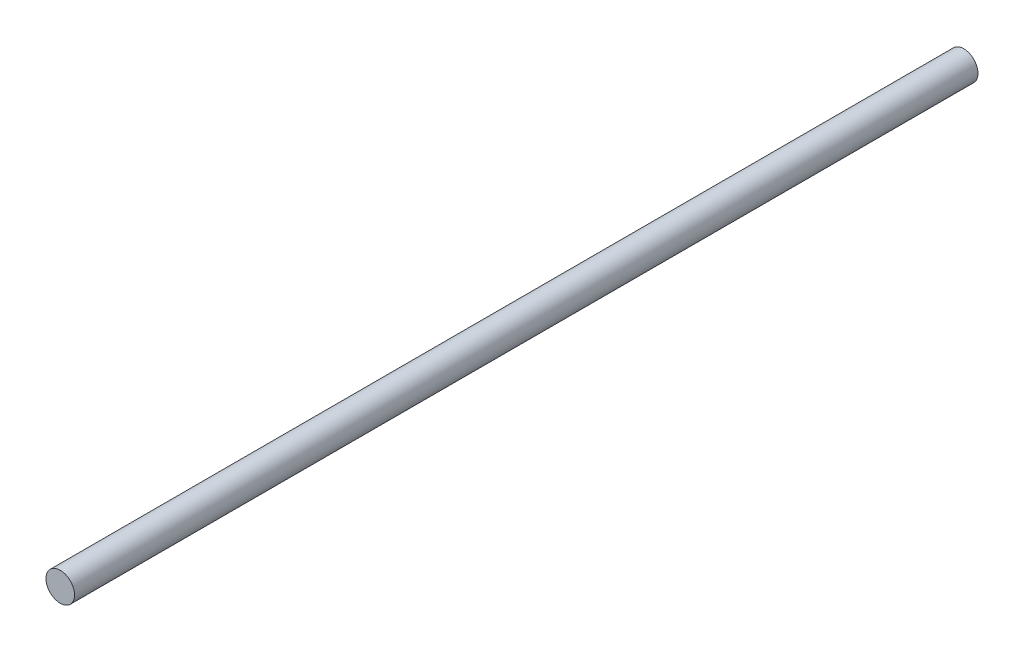
ISO-10303-21;
HEADER;
FILE_DESCRIPTION(('STEP AP214'),'2;1');
FILE_NAME('part.step','',(''),(''),'','','');
FILE_SCHEMA(('AUTOMOTIVE_DESIGN { 1 0 10303 214 1 1 1 1 }'));
ENDSEC;
DATA;
#1=APPLICATION_CONTEXT('core data for automotive mechanical design processes');
#2=APPLICATION_PROTOCOL_DEFINITION('international standard','automotive_design',2000,#1);
#3=PRODUCT_CONTEXT('',#1,'mechanical');
#4=PRODUCT('Part','Part','',(#3));
#5=PRODUCT_RELATED_PRODUCT_CATEGORY('part','',(#4));
#6=PRODUCT_DEFINITION_FORMATION('','',#4);
#7=PRODUCT_DEFINITION_CONTEXT('part definition',#1,'design');
#8=PRODUCT_DEFINITION('design','',#6,#7);
#9=PRODUCT_DEFINITION_SHAPE('','',#8);
#10=(LENGTH_UNIT() NAMED_UNIT(*) SI_UNIT(.MILLI.,.METRE.));
#11=(NAMED_UNIT(*) PLANE_ANGLE_UNIT() SI_UNIT($,.RADIAN.));
#12=(NAMED_UNIT(*) SI_UNIT($,.STERADIAN.) SOLID_ANGLE_UNIT());
#13=UNCERTAINTY_MEASURE_WITH_UNIT(LENGTH_MEASURE(1.E-05),#10,'distance_accuracy_value','');
#14=(GEOMETRIC_REPRESENTATION_CONTEXT(3) GLOBAL_UNCERTAINTY_ASSIGNED_CONTEXT((#13)) GLOBAL_UNIT_ASSIGNED_CONTEXT((#10,
#11,#12)) REPRESENTATION_CONTEXT('',''));
#15=CARTESIAN_POINT('',(0.,0.,0.));
#16=DIRECTION('',(0.,0.,1.));
#17=DIRECTION('',(1.,0.,0.));
#18=AXIS2_PLACEMENT_3D('',#15,#16,#17);
#19=CARTESIAN_POINT('',(-10.0165574589457,-10.0165574589457,250.739783017438));
#20=DIRECTION('',(0.,0.,-1.));
#21=DIRECTION('',(-1.,0.,0.));
#22=AXIS2_PLACEMENT_3D('',#19,#20,#21);
#23=CYLINDRICAL_SURFACE('',#22,3.79708670005155);
#24=CARTESIAN_POINT('',(-10.0165574589457,-10.0165574589457,0.));
#25=DIRECTION('',(0.,0.,1.));
#26=DIRECTION('',(1.,0.,0.));
#27=AXIS2_PLACEMENT_3D('',#24,#25,#26);
#28=CIRCLE('',#27,3.79708670005155);
#29=CARTESIAN_POINT('',(-6.21947075889412,-10.0165574589457,0.));
#30=VERTEX_POINT('',#29);
#31=EDGE_CURVE('E33',#30,#30,#28,.T.);
#32=ORIENTED_EDGE('',*,*,#31,.T.);
#33=EDGE_LOOP('',(#32));
#34=FACE_BOUND('',#33,.T.);
#35=CARTESIAN_POINT('',(-10.0165574589457,-10.0165574589457,239.999999999999));
#36=DIRECTION('',(0.,0.,1.));
#37=DIRECTION('',(1.,0.,0.));
#38=AXIS2_PLACEMENT_3D('',#35,#36,#37);
#39=CIRCLE('',#38,3.79708670005155);
#40=CARTESIAN_POINT('',(-6.21947075889412,-10.0165574589457,239.999999999999));
#41=VERTEX_POINT('',#40);
#42=EDGE_CURVE('E10',#41,#41,#39,.T.);
#43=ORIENTED_EDGE('',*,*,#42,.F.);
#44=EDGE_LOOP('',(#43));
#45=FACE_BOUND('',#44,.T.);
#46=ADVANCED_FACE('F30',(#34,#45),#23,.T.);
#47=CARTESIAN_POINT('',(-10.0165574589457,-10.0165574589457,0.));
#48=DIRECTION('',(0.,0.,1.));
#49=DIRECTION('',(1.,0.,0.));
#50=AXIS2_PLACEMENT_3D('',#47,#48,#49);
#51=PLANE('',#50);
#52=ORIENTED_EDGE('',*,*,#31,.F.);
#53=EDGE_LOOP('',(#52));
#54=FACE_BOUND('',#53,.T.);
#55=ADVANCED_FACE('F44',(#54),#51,.F.);
#56=CARTESIAN_POINT('',(-20.0331149178913,0.,239.999999999999));
#57=DIRECTION('',(0.,0.,1.));
#58=DIRECTION('',(1.,0.,0.));
#59=AXIS2_PLACEMENT_3D('',#56,#57,#58);
#60=PLANE('',#59);
#61=ORIENTED_EDGE('',*,*,#42,.T.);
#62=EDGE_LOOP('',(#61));
#63=FACE_BOUND('',#62,.T.);
#64=ADVANCED_FACE('F46',(#63),#60,.T.);
#65=CLOSED_SHELL('',(#46,#55,#64));
#66=MANIFOLD_SOLID_BREP('B2',#65);
#67=ADVANCED_BREP_SHAPE_REPRESENTATION('',(#18,#66),#14);
#68=SHAPE_DEFINITION_REPRESENTATION(#9,#67);
ENDSEC;
END-ISO-10303-21;
